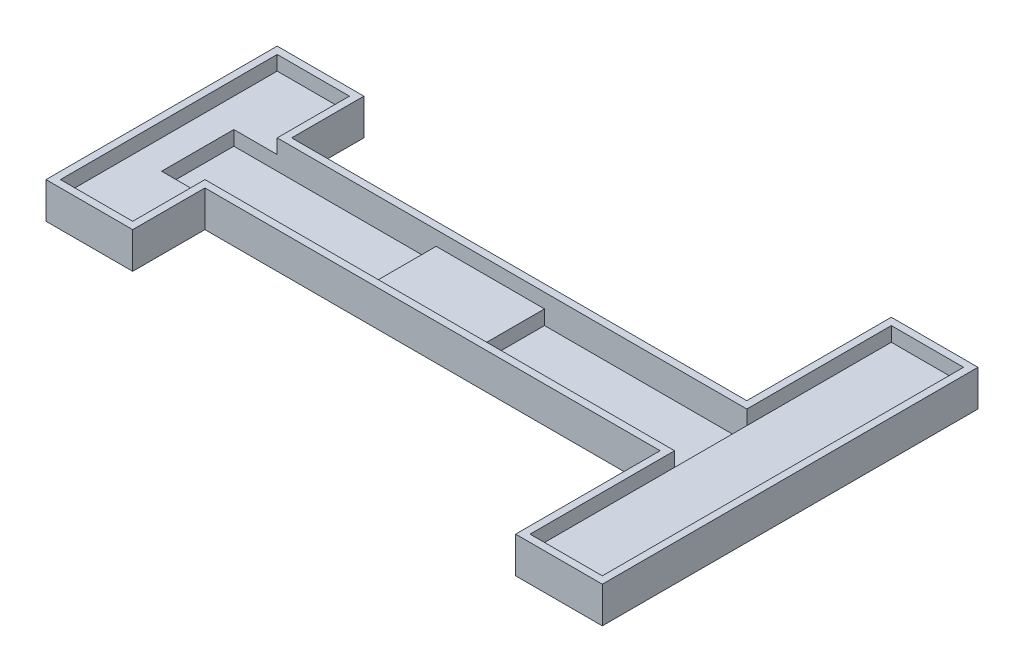
ISO-10303-21;
HEADER;
FILE_DESCRIPTION(('STEP AP214'),'2;1');
FILE_NAME('part.step','',(''),(''),'','','');
FILE_SCHEMA(('AUTOMOTIVE_DESIGN { 1 0 10303 214 1 1 1 1 }'));
ENDSEC;
DATA;
#1=APPLICATION_CONTEXT('core data for automotive mechanical design processes');
#2=APPLICATION_PROTOCOL_DEFINITION('international standard','automotive_design',2000,#1);
#3=PRODUCT_CONTEXT('',#1,'mechanical');
#4=PRODUCT('Part','Part','',(#3));
#5=PRODUCT_RELATED_PRODUCT_CATEGORY('part','',(#4));
#6=PRODUCT_DEFINITION_FORMATION('','',#4);
#7=PRODUCT_DEFINITION_CONTEXT('part definition',#1,'design');
#8=PRODUCT_DEFINITION('design','',#6,#7);
#9=PRODUCT_DEFINITION_SHAPE('','',#8);
#10=(LENGTH_UNIT() NAMED_UNIT(*) SI_UNIT(.MILLI.,.METRE.));
#11=(NAMED_UNIT(*) PLANE_ANGLE_UNIT() SI_UNIT($,.RADIAN.));
#12=(NAMED_UNIT(*) SI_UNIT($,.STERADIAN.) SOLID_ANGLE_UNIT());
#13=UNCERTAINTY_MEASURE_WITH_UNIT(LENGTH_MEASURE(1.E-05),#10,'distance_accuracy_value','');
#14=(GEOMETRIC_REPRESENTATION_CONTEXT(3) GLOBAL_UNCERTAINTY_ASSIGNED_CONTEXT((#13)) GLOBAL_UNIT_ASSIGNED_CONTEXT((#10,
#11,#12)) REPRESENTATION_CONTEXT('',''));
#15=CARTESIAN_POINT('',(0.,0.,0.));
#16=DIRECTION('',(0.,0.,1.));
#17=DIRECTION('',(1.,0.,0.));
#18=AXIS2_PLACEMENT_3D('',#15,#16,#17);
#19=CARTESIAN_POINT('',(0.,1.,0.));
#20=DIRECTION('',(0.,1.,0.));
#21=DIRECTION('',(0.,0.,1.));
#22=AXIS2_PLACEMENT_3D('',#19,#20,#21);
#23=PLANE('',#22);
#24=DIRECTION('',(1.,0.,0.));
#25=VECTOR('',#24,1.);
#26=CARTESIAN_POINT('',(0.,1.,-5.));
#27=LINE('',#26,#25);
#28=CARTESIAN_POINT('',(-57.,1.,-5.));
#29=VERTEX_POINT('',#28);
#30=CARTESIAN_POINT('',(-29.,1.,-5.));
#31=VERTEX_POINT('',#30);
#32=EDGE_CURVE('E45',#29,#31,#27,.T.);
#33=ORIENTED_EDGE('',*,*,#32,.F.);
#34=DIRECTION('',(0.,0.,-1.));
#35=VECTOR('',#34,1.);
#36=CARTESIAN_POINT('',(-57.,1.,-5.));
#37=LINE('',#36,#35);
#38=CARTESIAN_POINT('',(-57.,1.,5.));
#39=VERTEX_POINT('',#38);
#40=EDGE_CURVE('E249',#39,#29,#37,.T.);
#41=ORIENTED_EDGE('',*,*,#40,.F.);
#42=DIRECTION('',(1.,0.,0.));
#43=VECTOR('',#42,1.);
#44=CARTESIAN_POINT('',(0.,1.,5.));
#45=LINE('',#44,#43);
#46=CARTESIAN_POINT('',(-29.,1.,5.));
#47=VERTEX_POINT('',#46);
#48=EDGE_CURVE('E352',#39,#47,#45,.T.);
#49=ORIENTED_EDGE('',*,*,#48,.T.);
#50=DIRECTION('',(0.,0.,1.));
#51=VECTOR('',#50,1.);
#52=CARTESIAN_POINT('',(-29.,1.,-5.));
#53=LINE('',#52,#51);
#54=EDGE_CURVE('E393',#31,#47,#53,.T.);
#55=ORIENTED_EDGE('',*,*,#54,.F.);
#56=EDGE_LOOP('',(#33,#41,#49,#55));
#57=FACE_BOUND('',#56,.T.);
#58=ADVANCED_FACE('F37',(#57),#23,.T.);
#59=CARTESIAN_POINT('',(-14.,1.,5.));
#60=VERTEX_POINT('',#59);
#61=CARTESIAN_POINT('',(14.,1.,5.));
#62=VERTEX_POINT('',#61);
#63=EDGE_CURVE('E330',#60,#62,#45,.T.);
#64=ORIENTED_EDGE('',*,*,#63,.T.);
#65=DIRECTION('',(0.,0.,1.));
#66=VECTOR('',#65,1.);
#67=CARTESIAN_POINT('',(14.,1.,-25.));
#68=LINE('',#67,#66);
#69=CARTESIAN_POINT('',(14.,1.,-5.));
#70=VERTEX_POINT('',#69);
#71=EDGE_CURVE('E369',#70,#62,#68,.T.);
#72=ORIENTED_EDGE('',*,*,#71,.F.);
#73=CARTESIAN_POINT('',(-14.,1.,-5.));
#74=VERTEX_POINT('',#73);
#75=EDGE_CURVE('E354',#74,#70,#27,.T.);
#76=ORIENTED_EDGE('',*,*,#75,.F.);
#77=DIRECTION('',(0.,0.,-1.));
#78=VECTOR('',#77,1.);
#79=CARTESIAN_POINT('',(-14.,1.,-5.));
#80=LINE('',#79,#78);
#81=EDGE_CURVE('E367',#60,#74,#80,.T.);
#82=ORIENTED_EDGE('',*,*,#81,.F.);
#83=EDGE_LOOP('',(#64,#72,#76,#82));
#84=FACE_BOUND('',#83,.T.);
#85=ADVANCED_FACE('F366',(#84),#23,.T.);
#86=CARTESIAN_POINT('',(14.,0.,-5.));
#87=DIRECTION('',(0.,0.,-1.));
#88=DIRECTION('',(-1.,0.,0.));
#89=AXIS2_PLACEMENT_3D('',#86,#87,#88);
#90=PLANE('',#89);
#91=DIRECTION('',(0.,-1.,0.));
#92=VECTOR('',#91,1.);
#93=CARTESIAN_POINT('',(-29.,3.,-5.));
#94=LINE('',#93,#92);
#95=CARTESIAN_POINT('',(-29.,3.,-5.));
#96=VERTEX_POINT('',#95);
#97=EDGE_CURVE('E392',#96,#31,#94,.T.);
#98=ORIENTED_EDGE('',*,*,#97,.F.);
#99=DIRECTION('',(-1.,0.,0.));
#100=VECTOR('',#99,1.);
#101=CARTESIAN_POINT('',(-29.,3.,-5.));
#102=LINE('',#101,#100);
#103=CARTESIAN_POINT('',(-14.,3.,-5.));
#104=VERTEX_POINT('',#103);
#105=EDGE_CURVE('E390',#104,#96,#102,.T.);
#106=ORIENTED_EDGE('',*,*,#105,.F.);
#107=DIRECTION('',(0.,-1.,0.));
#108=VECTOR('',#107,1.);
#109=CARTESIAN_POINT('',(-14.,3.,-5.));
#110=LINE('',#109,#108);
#111=EDGE_CURVE('E361',#104,#74,#110,.T.);
#112=ORIENTED_EDGE('',*,*,#111,.T.);
#113=ORIENTED_EDGE('',*,*,#75,.T.);
#114=DIRECTION('',(0.,1.,0.));
#115=VECTOR('',#114,1.);
#116=CARTESIAN_POINT('',(14.,0.,-5.));
#117=LINE('',#116,#115);
#118=CARTESIAN_POINT('',(14.,3.,-5.));
#119=VERTEX_POINT('',#118);
#120=EDGE_CURVE('E265',#70,#119,#117,.T.);
#121=ORIENTED_EDGE('',*,*,#120,.T.);
#122=CARTESIAN_POINT('',(14.,5.,-5.));
#123=VERTEX_POINT('',#122);
#124=EDGE_CURVE('E270',#119,#123,#117,.T.);
#125=ORIENTED_EDGE('',*,*,#124,.T.);
#126=DIRECTION('',(-1.,0.,0.));
#127=VECTOR('',#126,1.);
#128=CARTESIAN_POINT('',(14.,5.,-5.));
#129=LINE('',#128,#127);
#130=CARTESIAN_POINT('',(-51.,5.,-5.));
#131=VERTEX_POINT('',#130);
#132=EDGE_CURVE('E263',#123,#131,#129,.T.);
#133=ORIENTED_EDGE('',*,*,#132,.T.);
#134=DIRECTION('',(0.,1.,0.));
#135=VECTOR('',#134,1.);
#136=CARTESIAN_POINT('',(-51.,0.,-5.));
#137=LINE('',#136,#135);
#138=CARTESIAN_POINT('',(-51.,3.,-5.));
#139=VERTEX_POINT('',#138);
#140=EDGE_CURVE('E255',#139,#131,#137,.T.);
#141=ORIENTED_EDGE('',*,*,#140,.F.);
#142=DIRECTION('',(1.,0.,0.));
#143=VECTOR('',#142,1.);
#144=CARTESIAN_POINT('',(-51.,3.,-5.));
#145=LINE('',#144,#143);
#146=CARTESIAN_POINT('',(-57.,3.,-5.));
#147=VERTEX_POINT('',#146);
#148=EDGE_CURVE('E238',#147,#139,#145,.T.);
#149=ORIENTED_EDGE('',*,*,#148,.F.);
#150=DIRECTION('',(0.,-1.,0.));
#151=VECTOR('',#150,1.);
#152=CARTESIAN_POINT('',(-57.,3.,-5.));
#153=LINE('',#152,#151);
#154=EDGE_CURVE('E377',#147,#29,#153,.T.);
#155=ORIENTED_EDGE('',*,*,#154,.T.);
#156=ORIENTED_EDGE('',*,*,#32,.T.);
#157=EDGE_LOOP('',(#98,#106,#112,#113,#121,#125,#133,#141,#149,#155,#156));
#158=FACE_BOUND('',#157,.T.);
#159=ADVANCED_FACE('F261',(#158),#90,.F.);
#160=CARTESIAN_POINT('',(-51.,0.,5.));
#161=DIRECTION('',(0.,0.,1.));
#162=DIRECTION('',(1.,0.,0.));
#163=AXIS2_PLACEMENT_3D('',#160,#161,#162);
#164=PLANE('',#163);
#165=DIRECTION('',(0.,-1.,0.));
#166=VECTOR('',#165,1.);
#167=CARTESIAN_POINT('',(-29.,3.,5.));
#168=LINE('',#167,#166);
#169=CARTESIAN_POINT('',(-29.,3.,5.));
#170=VERTEX_POINT('',#169);
#171=EDGE_CURVE('E400',#170,#47,#168,.T.);
#172=ORIENTED_EDGE('',*,*,#171,.T.);
#173=ORIENTED_EDGE('',*,*,#48,.F.);
#174=DIRECTION('',(0.,-1.,0.));
#175=VECTOR('',#174,1.);
#176=CARTESIAN_POINT('',(-57.,3.,5.));
#177=LINE('',#176,#175);
#178=CARTESIAN_POINT('',(-57.,3.,5.));
#179=VERTEX_POINT('',#178);
#180=EDGE_CURVE('E372',#179,#39,#177,.T.);
#181=ORIENTED_EDGE('',*,*,#180,.F.);
#182=DIRECTION('',(-1.,0.,0.));
#183=VECTOR('',#182,1.);
#184=CARTESIAN_POINT('',(-57.,3.,5.));
#185=LINE('',#184,#183);
#186=CARTESIAN_POINT('',(-51.,3.,5.));
#187=VERTEX_POINT('',#186);
#188=EDGE_CURVE('E491',#187,#179,#185,.T.);
#189=ORIENTED_EDGE('',*,*,#188,.F.);
#190=DIRECTION('',(0.,1.,0.));
#191=VECTOR('',#190,1.);
#192=CARTESIAN_POINT('',(-51.,0.,5.));
#193=LINE('',#192,#191);
#194=CARTESIAN_POINT('',(-51.,5.,5.));
#195=VERTEX_POINT('',#194);
#196=EDGE_CURVE('E285',#187,#195,#193,.T.);
#197=ORIENTED_EDGE('',*,*,#196,.T.);
#198=DIRECTION('',(1.,0.,0.));
#199=VECTOR('',#198,1.);
#200=CARTESIAN_POINT('',(-51.,5.,5.));
#201=LINE('',#200,#199);
#202=CARTESIAN_POINT('',(14.,5.,5.));
#203=VERTEX_POINT('',#202);
#204=EDGE_CURVE('E409',#195,#203,#201,.T.);
#205=ORIENTED_EDGE('',*,*,#204,.T.);
#206=DIRECTION('',(0.,1.,0.));
#207=VECTOR('',#206,1.);
#208=CARTESIAN_POINT('',(14.,0.,5.));
#209=LINE('',#208,#207);
#210=CARTESIAN_POINT('',(14.,3.,5.));
#211=VERTEX_POINT('',#210);
#212=EDGE_CURVE('E284',#211,#203,#209,.T.);
#213=ORIENTED_EDGE('',*,*,#212,.F.);
#214=EDGE_CURVE('E282',#62,#211,#209,.T.);
#215=ORIENTED_EDGE('',*,*,#214,.F.);
#216=ORIENTED_EDGE('',*,*,#63,.F.);
#217=DIRECTION('',(0.,-1.,0.));
#218=VECTOR('',#217,1.);
#219=CARTESIAN_POINT('',(-14.,3.,5.));
#220=LINE('',#219,#218);
#221=CARTESIAN_POINT('',(-14.,3.,5.));
#222=VERTEX_POINT('',#221);
#223=EDGE_CURVE('E398',#222,#60,#220,.T.);
#224=ORIENTED_EDGE('',*,*,#223,.F.);
#225=DIRECTION('',(1.,0.,0.));
#226=VECTOR('',#225,1.);
#227=CARTESIAN_POINT('',(-29.,3.,5.));
#228=LINE('',#227,#226);
#229=EDGE_CURVE('E386',#170,#222,#228,.T.);
#230=ORIENTED_EDGE('',*,*,#229,.F.);
#231=EDGE_LOOP('',(#172,#173,#181,#189,#197,#205,#213,#215,#216,#224,#230));
#232=FACE_BOUND('',#231,.T.);
#233=ADVANCED_FACE('F530',(#232),#164,.F.);
#234=CARTESIAN_POINT('',(-62.,0.,16.));
#235=DIRECTION('',(0.,0.,1.));
#236=DIRECTION('',(1.,0.,0.));
#237=AXIS2_PLACEMENT_3D('',#234,#235,#236);
#238=PLANE('',#237);
#239=DIRECTION('',(0.,1.,0.));
#240=VECTOR('',#239,1.);
#241=CARTESIAN_POINT('',(-50.,0.,16.));
#242=LINE('',#241,#240);
#243=CARTESIAN_POINT('',(-50.,0.,16.));
#244=VERTEX_POINT('',#243);
#245=CARTESIAN_POINT('',(-50.,5.,16.));
#246=VERTEX_POINT('',#245);
#247=EDGE_CURVE('E327',#244,#246,#242,.T.);
#248=ORIENTED_EDGE('',*,*,#247,.T.);
#249=DIRECTION('',(1.,0.,0.));
#250=VECTOR('',#249,1.);
#251=CARTESIAN_POINT('',(-62.,5.,16.));
#252=LINE('',#251,#250);
#253=CARTESIAN_POINT('',(-62.,5.,16.));
#254=VERTEX_POINT('',#253);
#255=EDGE_CURVE('E436',#254,#246,#252,.T.);
#256=ORIENTED_EDGE('',*,*,#255,.F.);
#257=DIRECTION('',(0.,1.,0.));
#258=VECTOR('',#257,1.);
#259=CARTESIAN_POINT('',(-62.,0.,16.));
#260=LINE('',#259,#258);
#261=CARTESIAN_POINT('',(-62.,0.,16.));
#262=VERTEX_POINT('',#261);
#263=EDGE_CURVE('E328',#262,#254,#260,.T.);
#264=ORIENTED_EDGE('',*,*,#263,.F.);
#265=DIRECTION('',(1.,0.,0.));
#266=VECTOR('',#265,1.);
#267=CARTESIAN_POINT('',(-62.,0.,16.));
#268=LINE('',#267,#266);
#269=EDGE_CURVE('E290',#262,#244,#268,.T.);
#270=ORIENTED_EDGE('',*,*,#269,.T.);
#271=EDGE_LOOP('',(#248,#256,#264,#270));
#272=FACE_BOUND('',#271,.T.);
#273=ADVANCED_FACE('F565',(#272),#238,.T.);
#274=CARTESIAN_POINT('',(-62.,0.,-16.));
#275=DIRECTION('',(-1.,0.,0.));
#276=DIRECTION('',(0.,0.,1.));
#277=AXIS2_PLACEMENT_3D('',#274,#275,#276);
#278=PLANE('',#277);
#279=ORIENTED_EDGE('',*,*,#263,.T.);
#280=DIRECTION('',(0.,0.,1.));
#281=VECTOR('',#280,1.);
#282=CARTESIAN_POINT('',(-62.,5.,-16.));
#283=LINE('',#282,#281);
#284=CARTESIAN_POINT('',(-62.,5.,-16.));
#285=VERTEX_POINT('',#284);
#286=EDGE_CURVE('E289',#285,#254,#283,.T.);
#287=ORIENTED_EDGE('',*,*,#286,.F.);
#288=DIRECTION('',(0.,1.,0.));
#289=VECTOR('',#288,1.);
#290=CARTESIAN_POINT('',(-62.,0.,-16.));
#291=LINE('',#290,#289);
#292=CARTESIAN_POINT('',(-62.,0.,-16.));
#293=VERTEX_POINT('',#292);
#294=EDGE_CURVE('E331',#293,#285,#291,.T.);
#295=ORIENTED_EDGE('',*,*,#294,.F.);
#296=DIRECTION('',(0.,0.,1.));
#297=VECTOR('',#296,1.);
#298=CARTESIAN_POINT('',(-62.,0.,-16.));
#299=LINE('',#298,#297);
#300=EDGE_CURVE('E324',#293,#262,#299,.T.);
#301=ORIENTED_EDGE('',*,*,#300,.T.);
#302=EDGE_LOOP('',(#279,#287,#295,#301));
#303=FACE_BOUND('',#302,.T.);
#304=ADVANCED_FACE('F568',(#303),#278,.T.);
#305=CARTESIAN_POINT('',(-50.,0.,-16.));
#306=DIRECTION('',(0.,0.,-1.));
#307=DIRECTION('',(-1.,0.,0.));
#308=AXIS2_PLACEMENT_3D('',#305,#306,#307);
#309=PLANE('',#308);
#310=ORIENTED_EDGE('',*,*,#294,.T.);
#311=DIRECTION('',(-1.,0.,0.));
#312=VECTOR('',#311,1.);
#313=CARTESIAN_POINT('',(-50.,5.,-16.));
#314=LINE('',#313,#312);
#315=CARTESIAN_POINT('',(-50.,5.,-16.));
#316=VERTEX_POINT('',#315);
#317=EDGE_CURVE('E466',#316,#285,#314,.T.);
#318=ORIENTED_EDGE('',*,*,#317,.F.);
#319=DIRECTION('',(0.,1.,0.));
#320=VECTOR('',#319,1.);
#321=CARTESIAN_POINT('',(-50.,0.,-16.));
#322=LINE('',#321,#320);
#323=CARTESIAN_POINT('',(-50.,0.,-16.));
#324=VERTEX_POINT('',#323);
#325=EDGE_CURVE('E333',#324,#316,#322,.T.);
#326=ORIENTED_EDGE('',*,*,#325,.F.);
#327=DIRECTION('',(-1.,0.,0.));
#328=VECTOR('',#327,1.);
#329=CARTESIAN_POINT('',(-50.,0.,-16.));
#330=LINE('',#329,#328);
#331=EDGE_CURVE('E321',#324,#293,#330,.T.);
#332=ORIENTED_EDGE('',*,*,#331,.T.);
#333=EDGE_LOOP('',(#310,#318,#326,#332));
#334=FACE_BOUND('',#333,.T.);
#335=ADVANCED_FACE('F605',(#334),#309,.T.);
#336=CARTESIAN_POINT('',(-50.,0.,-6.));
#337=DIRECTION('',(1.,0.,0.));
#338=DIRECTION('',(0.,0.,-1.));
#339=AXIS2_PLACEMENT_3D('',#336,#337,#338);
#340=PLANE('',#339);
#341=ORIENTED_EDGE('',*,*,#325,.T.);
#342=DIRECTION('',(0.,0.,-1.));
#343=VECTOR('',#342,1.);
#344=CARTESIAN_POINT('',(-50.,5.,-6.));
#345=LINE('',#344,#343);
#346=CARTESIAN_POINT('',(-50.,5.,-6.));
#347=VERTEX_POINT('',#346);
#348=EDGE_CURVE('E463',#347,#316,#345,.T.);
#349=ORIENTED_EDGE('',*,*,#348,.F.);
#350=DIRECTION('',(0.,1.,0.));
#351=VECTOR('',#350,1.);
#352=CARTESIAN_POINT('',(-50.,0.,-6.));
#353=LINE('',#352,#351);
#354=CARTESIAN_POINT('',(-50.,0.,-6.));
#355=VERTEX_POINT('',#354);
#356=EDGE_CURVE('E335',#355,#347,#353,.T.);
#357=ORIENTED_EDGE('',*,*,#356,.F.);
#358=DIRECTION('',(0.,0.,-1.));
#359=VECTOR('',#358,1.);
#360=CARTESIAN_POINT('',(-50.,0.,-6.));
#361=LINE('',#360,#359);
#362=EDGE_CURVE('E318',#355,#324,#361,.T.);
#363=ORIENTED_EDGE('',*,*,#362,.T.);
#364=EDGE_LOOP('',(#341,#349,#357,#363));
#365=FACE_BOUND('',#364,.T.);
#366=ADVANCED_FACE('F601',(#365),#340,.T.);
#367=CARTESIAN_POINT('',(13.,0.,-6.));
#368=DIRECTION('',(0.,0.,-1.));
#369=DIRECTION('',(-1.,0.,0.));
#370=AXIS2_PLACEMENT_3D('',#367,#368,#369);
#371=PLANE('',#370);
#372=ORIENTED_EDGE('',*,*,#356,.T.);
#373=DIRECTION('',(-1.,0.,0.));
#374=VECTOR('',#373,1.);
#375=CARTESIAN_POINT('',(13.,5.,-6.));
#376=LINE('',#375,#374);
#377=CARTESIAN_POINT('',(13.,5.,-6.));
#378=VERTEX_POINT('',#377);
#379=EDGE_CURVE('E460',#378,#347,#376,.T.);
#380=ORIENTED_EDGE('',*,*,#379,.F.);
#381=DIRECTION('',(0.,1.,0.));
#382=VECTOR('',#381,1.);
#383=CARTESIAN_POINT('',(13.,0.,-6.));
#384=LINE('',#383,#382);
#385=CARTESIAN_POINT('',(13.,0.,-6.));
#386=VERTEX_POINT('',#385);
#387=EDGE_CURVE('E337',#386,#378,#384,.T.);
#388=ORIENTED_EDGE('',*,*,#387,.F.);
#389=DIRECTION('',(-1.,0.,0.));
#390=VECTOR('',#389,1.);
#391=CARTESIAN_POINT('',(13.,0.,-6.));
#392=LINE('',#391,#390);
#393=EDGE_CURVE('E315',#386,#355,#392,.T.);
#394=ORIENTED_EDGE('',*,*,#393,.T.);
#395=EDGE_LOOP('',(#372,#380,#388,#394));
#396=FACE_BOUND('',#395,.T.);
#397=ADVANCED_FACE('F597',(#396),#371,.T.);
#398=CARTESIAN_POINT('',(13.,0.,-26.));
#399=DIRECTION('',(-1.,0.,0.));
#400=DIRECTION('',(0.,0.,1.));
#401=AXIS2_PLACEMENT_3D('',#398,#399,#400);
#402=PLANE('',#401);
#403=ORIENTED_EDGE('',*,*,#387,.T.);
#404=DIRECTION('',(0.,0.,1.));
#405=VECTOR('',#404,1.);
#406=CARTESIAN_POINT('',(13.,5.,-26.));
#407=LINE('',#406,#405);
#408=CARTESIAN_POINT('',(13.,5.,-26.));
#409=VERTEX_POINT('',#408);
#410=EDGE_CURVE('E457',#409,#378,#407,.T.);
#411=ORIENTED_EDGE('',*,*,#410,.F.);
#412=DIRECTION('',(0.,1.,0.));
#413=VECTOR('',#412,1.);
#414=CARTESIAN_POINT('',(13.,0.,-26.));
#415=LINE('',#414,#413);
#416=CARTESIAN_POINT('',(13.,0.,-26.));
#417=VERTEX_POINT('',#416);
#418=EDGE_CURVE('E339',#417,#409,#415,.T.);
#419=ORIENTED_EDGE('',*,*,#418,.F.);
#420=DIRECTION('',(0.,0.,1.));
#421=VECTOR('',#420,1.);
#422=CARTESIAN_POINT('',(13.,0.,-26.));
#423=LINE('',#422,#421);
#424=EDGE_CURVE('E312',#417,#386,#423,.T.);
#425=ORIENTED_EDGE('',*,*,#424,.T.);
#426=EDGE_LOOP('',(#403,#411,#419,#425));
#427=FACE_BOUND('',#426,.T.);
#428=ADVANCED_FACE('F593',(#427),#402,.T.);
#429=CARTESIAN_POINT('',(25.,0.,-26.));
#430=DIRECTION('',(0.,0.,-1.));
#431=DIRECTION('',(-1.,0.,0.));
#432=AXIS2_PLACEMENT_3D('',#429,#430,#431);
#433=PLANE('',#432);
#434=ORIENTED_EDGE('',*,*,#418,.T.);
#435=DIRECTION('',(-1.,0.,0.));
#436=VECTOR('',#435,1.);
#437=CARTESIAN_POINT('',(25.,5.,-26.));
#438=LINE('',#437,#436);
#439=CARTESIAN_POINT('',(25.,5.,-26.));
#440=VERTEX_POINT('',#439);
#441=EDGE_CURVE('E454',#440,#409,#438,.T.);
#442=ORIENTED_EDGE('',*,*,#441,.F.);
#443=DIRECTION('',(0.,1.,0.));
#444=VECTOR('',#443,1.);
#445=CARTESIAN_POINT('',(25.,0.,-26.));
#446=LINE('',#445,#444);
#447=CARTESIAN_POINT('',(25.,0.,-26.));
#448=VERTEX_POINT('',#447);
#449=EDGE_CURVE('E341',#448,#440,#446,.T.);
#450=ORIENTED_EDGE('',*,*,#449,.F.);
#451=DIRECTION('',(-1.,0.,0.));
#452=VECTOR('',#451,1.);
#453=CARTESIAN_POINT('',(25.,0.,-26.));
#454=LINE('',#453,#452);
#455=EDGE_CURVE('E309',#448,#417,#454,.T.);
#456=ORIENTED_EDGE('',*,*,#455,.T.);
#457=EDGE_LOOP('',(#434,#442,#450,#456));
#458=FACE_BOUND('',#457,.T.);
#459=ADVANCED_FACE('F589',(#458),#433,.T.);
#460=CARTESIAN_POINT('',(25.,0.,26.));
#461=DIRECTION('',(1.,0.,0.));
#462=DIRECTION('',(0.,0.,-1.));
#463=AXIS2_PLACEMENT_3D('',#460,#461,#462);
#464=PLANE('',#463);
#465=ORIENTED_EDGE('',*,*,#449,.T.);
#466=DIRECTION('',(0.,0.,-1.));
#467=VECTOR('',#466,1.);
#468=CARTESIAN_POINT('',(25.,5.,26.));
#469=LINE('',#468,#467);
#470=CARTESIAN_POINT('',(25.,5.,26.));
#471=VERTEX_POINT('',#470);
#472=EDGE_CURVE('E451',#471,#440,#469,.T.);
#473=ORIENTED_EDGE('',*,*,#472,.F.);
#474=DIRECTION('',(0.,1.,0.));
#475=VECTOR('',#474,1.);
#476=CARTESIAN_POINT('',(25.,0.,26.));
#477=LINE('',#476,#475);
#478=CARTESIAN_POINT('',(25.,0.,26.));
#479=VERTEX_POINT('',#478);
#480=EDGE_CURVE('E343',#479,#471,#477,.T.);
#481=ORIENTED_EDGE('',*,*,#480,.F.);
#482=DIRECTION('',(0.,0.,-1.));
#483=VECTOR('',#482,1.);
#484=CARTESIAN_POINT('',(25.,0.,26.));
#485=LINE('',#484,#483);
#486=EDGE_CURVE('E306',#479,#448,#485,.T.);
#487=ORIENTED_EDGE('',*,*,#486,.T.);
#488=EDGE_LOOP('',(#465,#473,#481,#487));
#489=FACE_BOUND('',#488,.T.);
#490=ADVANCED_FACE('F585',(#489),#464,.T.);
#491=CARTESIAN_POINT('',(13.,0.,26.));
#492=DIRECTION('',(0.,0.,1.));
#493=DIRECTION('',(1.,0.,0.));
#494=AXIS2_PLACEMENT_3D('',#491,#492,#493);
#495=PLANE('',#494);
#496=ORIENTED_EDGE('',*,*,#480,.T.);
#497=DIRECTION('',(1.,0.,0.));
#498=VECTOR('',#497,1.);
#499=CARTESIAN_POINT('',(13.,5.,26.));
#500=LINE('',#499,#498);
#501=CARTESIAN_POINT('',(13.,5.,26.));
#502=VERTEX_POINT('',#501);
#503=EDGE_CURVE('E448',#502,#471,#500,.T.);
#504=ORIENTED_EDGE('',*,*,#503,.F.);
#505=DIRECTION('',(0.,1.,0.));
#506=VECTOR('',#505,1.);
#507=CARTESIAN_POINT('',(13.,0.,26.));
#508=LINE('',#507,#506);
#509=CARTESIAN_POINT('',(13.,0.,26.));
#510=VERTEX_POINT('',#509);
#511=EDGE_CURVE('E345',#510,#502,#508,.T.);
#512=ORIENTED_EDGE('',*,*,#511,.F.);
#513=DIRECTION('',(1.,0.,0.));
#514=VECTOR('',#513,1.);
#515=CARTESIAN_POINT('',(13.,0.,26.));
#516=LINE('',#515,#514);
#517=EDGE_CURVE('E303',#510,#479,#516,.T.);
#518=ORIENTED_EDGE('',*,*,#517,.T.);
#519=EDGE_LOOP('',(#496,#504,#512,#518));
#520=FACE_BOUND('',#519,.T.);
#521=ADVANCED_FACE('F581',(#520),#495,.T.);
#522=CARTESIAN_POINT('',(13.,0.,6.));
#523=DIRECTION('',(-1.,0.,0.));
#524=DIRECTION('',(0.,0.,1.));
#525=AXIS2_PLACEMENT_3D('',#522,#523,#524);
#526=PLANE('',#525);
#527=ORIENTED_EDGE('',*,*,#511,.T.);
#528=DIRECTION('',(0.,0.,1.));
#529=VECTOR('',#528,1.);
#530=CARTESIAN_POINT('',(13.,5.,6.));
#531=LINE('',#530,#529);
#532=CARTESIAN_POINT('',(13.,5.,6.));
#533=VERTEX_POINT('',#532);
#534=EDGE_CURVE('E445',#533,#502,#531,.T.);
#535=ORIENTED_EDGE('',*,*,#534,.F.);
#536=DIRECTION('',(0.,1.,0.));
#537=VECTOR('',#536,1.);
#538=CARTESIAN_POINT('',(13.,0.,6.));
#539=LINE('',#538,#537);
#540=CARTESIAN_POINT('',(13.,0.,6.));
#541=VERTEX_POINT('',#540);
#542=EDGE_CURVE('E347',#541,#533,#539,.T.);
#543=ORIENTED_EDGE('',*,*,#542,.F.);
#544=DIRECTION('',(0.,0.,1.));
#545=VECTOR('',#544,1.);
#546=CARTESIAN_POINT('',(13.,0.,6.));
#547=LINE('',#546,#545);
#548=EDGE_CURVE('E300',#541,#510,#547,.T.);
#549=ORIENTED_EDGE('',*,*,#548,.T.);
#550=EDGE_LOOP('',(#527,#535,#543,#549));
#551=FACE_BOUND('',#550,.T.);
#552=ADVANCED_FACE('F577',(#551),#526,.T.);
#553=CARTESIAN_POINT('',(-50.,0.,6.));
#554=DIRECTION('',(0.,0.,1.));
#555=DIRECTION('',(1.,0.,0.));
#556=AXIS2_PLACEMENT_3D('',#553,#554,#555);
#557=PLANE('',#556);
#558=ORIENTED_EDGE('',*,*,#542,.T.);
#559=DIRECTION('',(1.,0.,0.));
#560=VECTOR('',#559,1.);
#561=CARTESIAN_POINT('',(-50.,5.,6.));
#562=LINE('',#561,#560);
#563=CARTESIAN_POINT('',(-50.,5.,6.));
#564=VERTEX_POINT('',#563);
#565=EDGE_CURVE('E442',#564,#533,#562,.T.);
#566=ORIENTED_EDGE('',*,*,#565,.F.);
#567=DIRECTION('',(0.,1.,0.));
#568=VECTOR('',#567,1.);
#569=CARTESIAN_POINT('',(-50.,0.,6.));
#570=LINE('',#569,#568);
#571=CARTESIAN_POINT('',(-50.,0.,6.));
#572=VERTEX_POINT('',#571);
#573=EDGE_CURVE('E349',#572,#564,#570,.T.);
#574=ORIENTED_EDGE('',*,*,#573,.F.);
#575=DIRECTION('',(1.,0.,0.));
#576=VECTOR('',#575,1.);
#577=CARTESIAN_POINT('',(-50.,0.,6.));
#578=LINE('',#577,#576);
#579=EDGE_CURVE('E297',#572,#541,#578,.T.);
#580=ORIENTED_EDGE('',*,*,#579,.T.);
#581=EDGE_LOOP('',(#558,#566,#574,#580));
#582=FACE_BOUND('',#581,.T.);
#583=ADVANCED_FACE('F573',(#582),#557,.T.);
#584=CARTESIAN_POINT('',(-50.,0.,16.));
#585=DIRECTION('',(1.,0.,0.));
#586=DIRECTION('',(0.,0.,-1.));
#587=AXIS2_PLACEMENT_3D('',#584,#585,#586);
#588=PLANE('',#587);
#589=ORIENTED_EDGE('',*,*,#573,.T.);
#590=DIRECTION('',(0.,0.,-1.));
#591=VECTOR('',#590,1.);
#592=CARTESIAN_POINT('',(-50.,5.,16.));
#593=LINE('',#592,#591);
#594=EDGE_CURVE('E439',#246,#564,#593,.T.);
#595=ORIENTED_EDGE('',*,*,#594,.F.);
#596=ORIENTED_EDGE('',*,*,#247,.F.);
#597=DIRECTION('',(0.,0.,-1.));
#598=VECTOR('',#597,1.);
#599=CARTESIAN_POINT('',(-50.,0.,16.));
#600=LINE('',#599,#598);
#601=EDGE_CURVE('E293',#244,#572,#600,.T.);
#602=ORIENTED_EDGE('',*,*,#601,.T.);
#603=EDGE_LOOP('',(#589,#595,#596,#602));
#604=FACE_BOUND('',#603,.T.);
#605=ADVANCED_FACE('F570',(#604),#588,.T.);
#606=CARTESIAN_POINT('',(-61.,0.,15.));
#607=DIRECTION('',(0.,0.,1.));
#608=DIRECTION('',(1.,0.,0.));
#609=AXIS2_PLACEMENT_3D('',#606,#607,#608);
#610=PLANE('',#609);
#611=DIRECTION('',(0.,1.,0.));
#612=VECTOR('',#611,1.);
#613=CARTESIAN_POINT('',(-51.,0.,15.));
#614=LINE('',#613,#612);
#615=CARTESIAN_POINT('',(-51.,3.,15.));
#616=VERTEX_POINT('',#615);
#617=CARTESIAN_POINT('',(-51.,5.,15.));
#618=VERTEX_POINT('',#617);
#619=EDGE_CURVE('E287',#616,#618,#614,.T.);
#620=ORIENTED_EDGE('',*,*,#619,.F.);
#621=DIRECTION('',(1.,0.,0.));
#622=VECTOR('',#621,1.);
#623=CARTESIAN_POINT('',(-51.,3.,15.));
#624=LINE('',#623,#622);
#625=CARTESIAN_POINT('',(-61.,3.,15.));
#626=VERTEX_POINT('',#625);
#627=EDGE_CURVE('E52',#626,#616,#624,.T.);
#628=ORIENTED_EDGE('',*,*,#627,.F.);
#629=DIRECTION('',(0.,1.,0.));
#630=VECTOR('',#629,1.);
#631=CARTESIAN_POINT('',(-61.,0.,15.));
#632=LINE('',#631,#630);
#633=CARTESIAN_POINT('',(-61.,5.,15.));
#634=VERTEX_POINT('',#633);
#635=EDGE_CURVE('E294',#626,#634,#632,.T.);
#636=ORIENTED_EDGE('',*,*,#635,.T.);
#637=DIRECTION('',(1.,0.,0.));
#638=VECTOR('',#637,1.);
#639=CARTESIAN_POINT('',(-61.,5.,15.));
#640=LINE('',#639,#638);
#641=EDGE_CURVE('E403',#634,#618,#640,.T.);
#642=ORIENTED_EDGE('',*,*,#641,.T.);
#643=EDGE_LOOP('',(#620,#628,#636,#642));
#644=FACE_BOUND('',#643,.T.);
#645=ADVANCED_FACE('F488',(#644),#610,.F.);
#646=CARTESIAN_POINT('',(-61.,0.,-15.));
#647=DIRECTION('',(-1.,0.,0.));
#648=DIRECTION('',(0.,0.,1.));
#649=AXIS2_PLACEMENT_3D('',#646,#647,#648);
#650=PLANE('',#649);
#651=ORIENTED_EDGE('',*,*,#635,.F.);
#652=DIRECTION('',(0.,0.,1.));
#653=VECTOR('',#652,1.);
#654=CARTESIAN_POINT('',(-61.,3.,15.));
#655=LINE('',#654,#653);
#656=CARTESIAN_POINT('',(-61.,3.,-15.));
#657=VERTEX_POINT('',#656);
#658=EDGE_CURVE('E478',#657,#626,#655,.T.);
#659=ORIENTED_EDGE('',*,*,#658,.F.);
#660=DIRECTION('',(0.,1.,0.));
#661=VECTOR('',#660,1.);
#662=CARTESIAN_POINT('',(-61.,0.,-15.));
#663=LINE('',#662,#661);
#664=CARTESIAN_POINT('',(-61.,5.,-15.));
#665=VERTEX_POINT('',#664);
#666=EDGE_CURVE('E267',#657,#665,#663,.T.);
#667=ORIENTED_EDGE('',*,*,#666,.T.);
#668=DIRECTION('',(0.,0.,1.));
#669=VECTOR('',#668,1.);
#670=CARTESIAN_POINT('',(-61.,5.,-15.));
#671=LINE('',#670,#669);
#672=EDGE_CURVE('E433',#665,#634,#671,.T.);
#673=ORIENTED_EDGE('',*,*,#672,.T.);
#674=EDGE_LOOP('',(#651,#659,#667,#673));
#675=FACE_BOUND('',#674,.T.);
#676=ADVANCED_FACE('F475',(#675),#650,.F.);
#677=CARTESIAN_POINT('',(-51.,0.,-15.));
#678=DIRECTION('',(0.,0.,-1.));
#679=DIRECTION('',(-1.,0.,0.));
#680=AXIS2_PLACEMENT_3D('',#677,#678,#679);
#681=PLANE('',#680);
#682=ORIENTED_EDGE('',*,*,#666,.F.);
#683=DIRECTION('',(-1.,0.,0.));
#684=VECTOR('',#683,1.);
#685=CARTESIAN_POINT('',(-61.,3.,-15.));
#686=LINE('',#685,#684);
#687=CARTESIAN_POINT('',(-51.,3.,-15.));
#688=VERTEX_POINT('',#687);
#689=EDGE_CURVE('E258',#688,#657,#686,.T.);
#690=ORIENTED_EDGE('',*,*,#689,.F.);
#691=DIRECTION('',(0.,1.,0.));
#692=VECTOR('',#691,1.);
#693=CARTESIAN_POINT('',(-51.,0.,-15.));
#694=LINE('',#693,#692);
#695=CARTESIAN_POINT('',(-51.,5.,-15.));
#696=VERTEX_POINT('',#695);
#697=EDGE_CURVE('E257',#688,#696,#694,.T.);
#698=ORIENTED_EDGE('',*,*,#697,.T.);
#699=DIRECTION('',(-1.,0.,0.));
#700=VECTOR('',#699,1.);
#701=CARTESIAN_POINT('',(-51.,5.,-15.));
#702=LINE('',#701,#700);
#703=EDGE_CURVE('E430',#696,#665,#702,.T.);
#704=ORIENTED_EDGE('',*,*,#703,.T.);
#705=EDGE_LOOP('',(#682,#690,#698,#704));
#706=FACE_BOUND('',#705,.T.);
#707=ADVANCED_FACE('F481',(#706),#681,.F.);
#708=CARTESIAN_POINT('',(-51.,0.,-5.));
#709=DIRECTION('',(1.,0.,0.));
#710=DIRECTION('',(0.,0.,-1.));
#711=AXIS2_PLACEMENT_3D('',#708,#709,#710);
#712=PLANE('',#711);
#713=ORIENTED_EDGE('',*,*,#697,.F.);
#714=DIRECTION('',(0.,0.,-1.));
#715=VECTOR('',#714,1.);
#716=CARTESIAN_POINT('',(-51.,3.,-15.));
#717=LINE('',#716,#715);
#718=EDGE_CURVE('E241',#139,#688,#717,.T.);
#719=ORIENTED_EDGE('',*,*,#718,.F.);
#720=ORIENTED_EDGE('',*,*,#140,.T.);
#721=DIRECTION('',(0.,0.,-1.));
#722=VECTOR('',#721,1.);
#723=CARTESIAN_POINT('',(-51.,5.,-5.));
#724=LINE('',#723,#722);
#725=EDGE_CURVE('E428',#131,#696,#724,.T.);
#726=ORIENTED_EDGE('',*,*,#725,.T.);
#727=EDGE_LOOP('',(#713,#719,#720,#726));
#728=FACE_BOUND('',#727,.T.);
#729=ADVANCED_FACE('F253',(#728),#712,.F.);
#730=CARTESIAN_POINT('',(14.,0.,-25.));
#731=DIRECTION('',(-1.,0.,0.));
#732=DIRECTION('',(0.,0.,1.));
#733=AXIS2_PLACEMENT_3D('',#730,#731,#732);
#734=PLANE('',#733);
#735=ORIENTED_EDGE('',*,*,#124,.F.);
#736=DIRECTION('',(0.,0.,1.));
#737=VECTOR('',#736,1.);
#738=CARTESIAN_POINT('',(14.,3.,-25.));
#739=LINE('',#738,#737);
#740=CARTESIAN_POINT('',(14.,3.,-25.));
#741=VERTEX_POINT('',#740);
#742=EDGE_CURVE('E374',#741,#119,#739,.T.);
#743=ORIENTED_EDGE('',*,*,#742,.F.);
#744=DIRECTION('',(0.,1.,0.));
#745=VECTOR('',#744,1.);
#746=CARTESIAN_POINT('',(14.,0.,-25.));
#747=LINE('',#746,#745);
#748=CARTESIAN_POINT('',(14.,5.,-25.));
#749=VERTEX_POINT('',#748);
#750=EDGE_CURVE('E274',#741,#749,#747,.T.);
#751=ORIENTED_EDGE('',*,*,#750,.T.);
#752=DIRECTION('',(0.,0.,1.));
#753=VECTOR('',#752,1.);
#754=CARTESIAN_POINT('',(14.,5.,-25.));
#755=LINE('',#754,#753);
#756=EDGE_CURVE('E424',#749,#123,#755,.T.);
#757=ORIENTED_EDGE('',*,*,#756,.T.);
#758=EDGE_LOOP('',(#735,#743,#751,#757));
#759=FACE_BOUND('',#758,.T.);
#760=ADVANCED_FACE('F512',(#759),#734,.F.);
#761=CARTESIAN_POINT('',(24.,0.,-25.));
#762=DIRECTION('',(0.,0.,-1.));
#763=DIRECTION('',(-1.,0.,0.));
#764=AXIS2_PLACEMENT_3D('',#761,#762,#763);
#765=PLANE('',#764);
#766=ORIENTED_EDGE('',*,*,#750,.F.);
#767=DIRECTION('',(-1.,0.,0.));
#768=VECTOR('',#767,1.);
#769=CARTESIAN_POINT('',(14.,3.,-25.));
#770=LINE('',#769,#768);
#771=CARTESIAN_POINT('',(24.,3.,-25.));
#772=VERTEX_POINT('',#771);
#773=EDGE_CURVE('E381',#772,#741,#770,.T.);
#774=ORIENTED_EDGE('',*,*,#773,.F.);
#775=DIRECTION('',(0.,1.,0.));
#776=VECTOR('',#775,1.);
#777=CARTESIAN_POINT('',(24.,0.,-25.));
#778=LINE('',#777,#776);
#779=CARTESIAN_POINT('',(24.,5.,-25.));
#780=VERTEX_POINT('',#779);
#781=EDGE_CURVE('E276',#772,#780,#778,.T.);
#782=ORIENTED_EDGE('',*,*,#781,.T.);
#783=DIRECTION('',(-1.,0.,0.));
#784=VECTOR('',#783,1.);
#785=CARTESIAN_POINT('',(24.,5.,-25.));
#786=LINE('',#785,#784);
#787=EDGE_CURVE('E421',#780,#749,#786,.T.);
#788=ORIENTED_EDGE('',*,*,#787,.T.);
#789=EDGE_LOOP('',(#766,#774,#782,#788));
#790=FACE_BOUND('',#789,.T.);
#791=ADVANCED_FACE('F513',(#790),#765,.F.);
#792=CARTESIAN_POINT('',(24.,0.,25.));
#793=DIRECTION('',(1.,0.,0.));
#794=DIRECTION('',(0.,0.,-1.));
#795=AXIS2_PLACEMENT_3D('',#792,#793,#794);
#796=PLANE('',#795);
#797=ORIENTED_EDGE('',*,*,#781,.F.);
#798=DIRECTION('',(0.,0.,-1.));
#799=VECTOR('',#798,1.);
#800=CARTESIAN_POINT('',(24.,3.,-25.));
#801=LINE('',#800,#799);
#802=CARTESIAN_POINT('',(24.,3.,25.));
#803=VERTEX_POINT('',#802);
#804=EDGE_CURVE('E502',#803,#772,#801,.T.);
#805=ORIENTED_EDGE('',*,*,#804,.F.);
#806=DIRECTION('',(0.,1.,0.));
#807=VECTOR('',#806,1.);
#808=CARTESIAN_POINT('',(24.,0.,25.));
#809=LINE('',#808,#807);
#810=CARTESIAN_POINT('',(24.,5.,25.));
#811=VERTEX_POINT('',#810);
#812=EDGE_CURVE('E278',#803,#811,#809,.T.);
#813=ORIENTED_EDGE('',*,*,#812,.T.);
#814=DIRECTION('',(0.,0.,-1.));
#815=VECTOR('',#814,1.);
#816=CARTESIAN_POINT('',(24.,5.,25.));
#817=LINE('',#816,#815);
#818=EDGE_CURVE('E418',#811,#780,#817,.T.);
#819=ORIENTED_EDGE('',*,*,#818,.T.);
#820=EDGE_LOOP('',(#797,#805,#813,#819));
#821=FACE_BOUND('',#820,.T.);
#822=ADVANCED_FACE('F520',(#821),#796,.F.);
#823=CARTESIAN_POINT('',(14.,0.,25.));
#824=DIRECTION('',(0.,0.,1.));
#825=DIRECTION('',(1.,0.,0.));
#826=AXIS2_PLACEMENT_3D('',#823,#824,#825);
#827=PLANE('',#826);
#828=ORIENTED_EDGE('',*,*,#812,.F.);
#829=DIRECTION('',(1.,0.,0.));
#830=VECTOR('',#829,1.);
#831=CARTESIAN_POINT('',(14.,3.,25.));
#832=LINE('',#831,#830);
#833=CARTESIAN_POINT('',(14.,3.,25.));
#834=VERTEX_POINT('',#833);
#835=EDGE_CURVE('E501',#834,#803,#832,.T.);
#836=ORIENTED_EDGE('',*,*,#835,.F.);
#837=DIRECTION('',(0.,1.,0.));
#838=VECTOR('',#837,1.);
#839=CARTESIAN_POINT('',(14.,0.,25.));
#840=LINE('',#839,#838);
#841=CARTESIAN_POINT('',(14.,5.,25.));
#842=VERTEX_POINT('',#841);
#843=EDGE_CURVE('E280',#834,#842,#840,.T.);
#844=ORIENTED_EDGE('',*,*,#843,.T.);
#845=DIRECTION('',(1.,0.,0.));
#846=VECTOR('',#845,1.);
#847=CARTESIAN_POINT('',(14.,5.,25.));
#848=LINE('',#847,#846);
#849=EDGE_CURVE('E415',#842,#811,#848,.T.);
#850=ORIENTED_EDGE('',*,*,#849,.T.);
#851=EDGE_LOOP('',(#828,#836,#844,#850));
#852=FACE_BOUND('',#851,.T.);
#853=ADVANCED_FACE('F524',(#852),#827,.F.);
#854=CARTESIAN_POINT('',(14.,0.,5.));
#855=DIRECTION('',(-1.,0.,0.));
#856=DIRECTION('',(0.,0.,1.));
#857=AXIS2_PLACEMENT_3D('',#854,#855,#856);
#858=PLANE('',#857);
#859=ORIENTED_EDGE('',*,*,#843,.F.);
#860=DIRECTION('',(0.,0.,-1.));
#861=VECTOR('',#860,1.);
#862=CARTESIAN_POINT('',(14.,3.,5.));
#863=LINE('',#862,#861);
#864=EDGE_CURVE('E11',#834,#211,#863,.T.);
#865=ORIENTED_EDGE('',*,*,#864,.T.);
#866=ORIENTED_EDGE('',*,*,#212,.T.);
#867=DIRECTION('',(0.,0.,1.));
#868=VECTOR('',#867,1.);
#869=CARTESIAN_POINT('',(14.,5.,5.));
#870=LINE('',#869,#868);
#871=EDGE_CURVE('E412',#203,#842,#870,.T.);
#872=ORIENTED_EDGE('',*,*,#871,.T.);
#873=EDGE_LOOP('',(#859,#865,#866,#872));
#874=FACE_BOUND('',#873,.T.);
#875=ADVANCED_FACE('F527',(#874),#858,.F.);
#876=CARTESIAN_POINT('',(-51.,0.,15.));
#877=DIRECTION('',(1.,0.,0.));
#878=DIRECTION('',(0.,0.,-1.));
#879=AXIS2_PLACEMENT_3D('',#876,#877,#878);
#880=PLANE('',#879);
#881=ORIENTED_EDGE('',*,*,#196,.F.);
#882=DIRECTION('',(0.,0.,-1.));
#883=VECTOR('',#882,1.);
#884=CARTESIAN_POINT('',(-51.,3.,5.));
#885=LINE('',#884,#883);
#886=EDGE_CURVE('E489',#616,#187,#885,.T.);
#887=ORIENTED_EDGE('',*,*,#886,.F.);
#888=ORIENTED_EDGE('',*,*,#619,.T.);
#889=DIRECTION('',(0.,0.,-1.));
#890=VECTOR('',#889,1.);
#891=CARTESIAN_POINT('',(-51.,5.,15.));
#892=LINE('',#891,#890);
#893=EDGE_CURVE('E406',#618,#195,#892,.T.);
#894=ORIENTED_EDGE('',*,*,#893,.T.);
#895=EDGE_LOOP('',(#881,#887,#888,#894));
#896=FACE_BOUND('',#895,.T.);
#897=ADVANCED_FACE('F535',(#896),#880,.F.);
#898=CARTESIAN_POINT('',(0.,5.,0.));
#899=DIRECTION('',(0.,1.,0.));
#900=DIRECTION('',(0.,0.,1.));
#901=AXIS2_PLACEMENT_3D('',#898,#899,#900);
#902=PLANE('',#901);
#903=ORIENTED_EDGE('',*,*,#255,.T.);
#904=ORIENTED_EDGE('',*,*,#594,.T.);
#905=ORIENTED_EDGE('',*,*,#565,.T.);
#906=ORIENTED_EDGE('',*,*,#534,.T.);
#907=ORIENTED_EDGE('',*,*,#503,.T.);
#908=ORIENTED_EDGE('',*,*,#472,.T.);
#909=ORIENTED_EDGE('',*,*,#441,.T.);
#910=ORIENTED_EDGE('',*,*,#410,.T.);
#911=ORIENTED_EDGE('',*,*,#379,.T.);
#912=ORIENTED_EDGE('',*,*,#348,.T.);
#913=ORIENTED_EDGE('',*,*,#317,.T.);
#914=ORIENTED_EDGE('',*,*,#286,.T.);
#915=EDGE_LOOP('',(#903,#904,#905,#906,#907,#908,#909,#910,#911,#912,#913,#914));
#916=FACE_BOUND('',#915,.T.);
#917=ORIENTED_EDGE('',*,*,#893,.F.);
#918=ORIENTED_EDGE('',*,*,#641,.F.);
#919=ORIENTED_EDGE('',*,*,#672,.F.);
#920=ORIENTED_EDGE('',*,*,#703,.F.);
#921=ORIENTED_EDGE('',*,*,#725,.F.);
#922=ORIENTED_EDGE('',*,*,#132,.F.);
#923=ORIENTED_EDGE('',*,*,#756,.F.);
#924=ORIENTED_EDGE('',*,*,#787,.F.);
#925=ORIENTED_EDGE('',*,*,#818,.F.);
#926=ORIENTED_EDGE('',*,*,#849,.F.);
#927=ORIENTED_EDGE('',*,*,#871,.F.);
#928=ORIENTED_EDGE('',*,*,#204,.F.);
#929=EDGE_LOOP('',(#917,#918,#919,#920,#921,#922,#923,#924,#925,#926,#927,#928));
#930=FACE_BOUND('',#929,.T.);
#931=ADVANCED_FACE('F484',(#916,#930),#902,.T.);
#932=CARTESIAN_POINT('',(0.,0.,0.));
#933=DIRECTION('',(0.,1.,0.));
#934=DIRECTION('',(0.,0.,1.));
#935=AXIS2_PLACEMENT_3D('',#932,#933,#934);
#936=PLANE('',#935);
#937=ORIENTED_EDGE('',*,*,#269,.F.);
#938=ORIENTED_EDGE('',*,*,#300,.F.);
#939=ORIENTED_EDGE('',*,*,#331,.F.);
#940=ORIENTED_EDGE('',*,*,#362,.F.);
#941=ORIENTED_EDGE('',*,*,#393,.F.);
#942=ORIENTED_EDGE('',*,*,#424,.F.);
#943=ORIENTED_EDGE('',*,*,#455,.F.);
#944=ORIENTED_EDGE('',*,*,#486,.F.);
#945=ORIENTED_EDGE('',*,*,#517,.F.);
#946=ORIENTED_EDGE('',*,*,#548,.F.);
#947=ORIENTED_EDGE('',*,*,#579,.F.);
#948=ORIENTED_EDGE('',*,*,#601,.F.);
#949=EDGE_LOOP('',(#937,#938,#939,#940,#941,#942,#943,#944,#945,#946,#947,#948));
#950=FACE_BOUND('',#949,.T.);
#951=ADVANCED_FACE('F39',(#950),#936,.F.);
#952=CARTESIAN_POINT('',(-29.,3.,-5.));
#953=DIRECTION('',(1.,0.,0.));
#954=DIRECTION('',(0.,0.,-1.));
#955=AXIS2_PLACEMENT_3D('',#952,#953,#954);
#956=PLANE('',#955);
#957=ORIENTED_EDGE('',*,*,#54,.T.);
#958=ORIENTED_EDGE('',*,*,#171,.F.);
#959=DIRECTION('',(0.,0.,1.));
#960=VECTOR('',#959,1.);
#961=CARTESIAN_POINT('',(-29.,3.,-5.));
#962=LINE('',#961,#960);
#963=EDGE_CURVE('E383',#96,#170,#962,.T.);
#964=ORIENTED_EDGE('',*,*,#963,.F.);
#965=ORIENTED_EDGE('',*,*,#97,.T.);
#966=EDGE_LOOP('',(#957,#958,#964,#965));
#967=FACE_BOUND('',#966,.T.);
#968=ADVANCED_FACE('F542',(#967),#956,.F.);
#969=CARTESIAN_POINT('',(-14.,3.,-5.));
#970=DIRECTION('',(-1.,0.,0.));
#971=DIRECTION('',(0.,0.,1.));
#972=AXIS2_PLACEMENT_3D('',#969,#970,#971);
#973=PLANE('',#972);
#974=ORIENTED_EDGE('',*,*,#81,.T.);
#975=ORIENTED_EDGE('',*,*,#111,.F.);
#976=DIRECTION('',(0.,0.,-1.));
#977=VECTOR('',#976,1.);
#978=CARTESIAN_POINT('',(-14.,3.,-5.));
#979=LINE('',#978,#977);
#980=EDGE_CURVE('E388',#222,#104,#979,.T.);
#981=ORIENTED_EDGE('',*,*,#980,.F.);
#982=ORIENTED_EDGE('',*,*,#223,.T.);
#983=EDGE_LOOP('',(#974,#975,#981,#982));
#984=FACE_BOUND('',#983,.T.);
#985=ADVANCED_FACE('F550',(#984),#973,.F.);
#986=CARTESIAN_POINT('',(0.,3.,0.));
#987=DIRECTION('',(0.,1.,0.));
#988=DIRECTION('',(0.,0.,1.));
#989=AXIS2_PLACEMENT_3D('',#986,#987,#988);
#990=PLANE('',#989);
#991=ORIENTED_EDGE('',*,*,#963,.T.);
#992=ORIENTED_EDGE('',*,*,#229,.T.);
#993=ORIENTED_EDGE('',*,*,#980,.T.);
#994=ORIENTED_EDGE('',*,*,#105,.T.);
#995=EDGE_LOOP('',(#991,#992,#993,#994));
#996=FACE_BOUND('',#995,.T.);
#997=ADVANCED_FACE('F548',(#996),#990,.T.);
#998=CARTESIAN_POINT('',(14.,3.,-25.));
#999=DIRECTION('',(1.,0.,0.));
#1000=DIRECTION('',(0.,0.,-1.));
#1001=AXIS2_PLACEMENT_3D('',#998,#999,#1000);
#1002=PLANE('',#1001);
#1003=EDGE_CURVE('E60',#119,#211,#739,.T.);
#1004=ORIENTED_EDGE('',*,*,#1003,.F.);
#1005=ORIENTED_EDGE('',*,*,#120,.F.);
#1006=ORIENTED_EDGE('',*,*,#71,.T.);
#1007=ORIENTED_EDGE('',*,*,#214,.T.);
#1008=EDGE_LOOP('',(#1004,#1005,#1006,#1007));
#1009=FACE_BOUND('',#1008,.T.);
#1010=ADVANCED_FACE('F557',(#1009),#1002,.F.);
#1011=CARTESIAN_POINT('',(0.,3.,0.));
#1012=DIRECTION('',(0.,1.,0.));
#1013=DIRECTION('',(0.,0.,1.));
#1014=AXIS2_PLACEMENT_3D('',#1011,#1012,#1013);
#1015=PLANE('',#1014);
#1016=ORIENTED_EDGE('',*,*,#742,.T.);
#1017=ORIENTED_EDGE('',*,*,#1003,.T.);
#1018=ORIENTED_EDGE('',*,*,#864,.F.);
#1019=ORIENTED_EDGE('',*,*,#835,.T.);
#1020=ORIENTED_EDGE('',*,*,#804,.T.);
#1021=ORIENTED_EDGE('',*,*,#773,.T.);
#1022=EDGE_LOOP('',(#1016,#1017,#1018,#1019,#1020,#1021));
#1023=FACE_BOUND('',#1022,.T.);
#1024=ADVANCED_FACE('F506',(#1023),#1015,.T.);
#1025=CARTESIAN_POINT('',(-57.,3.,-5.));
#1026=DIRECTION('',(-1.,0.,0.));
#1027=DIRECTION('',(0.,0.,1.));
#1028=AXIS2_PLACEMENT_3D('',#1025,#1026,#1027);
#1029=PLANE('',#1028);
#1030=ORIENTED_EDGE('',*,*,#40,.T.);
#1031=ORIENTED_EDGE('',*,*,#154,.F.);
#1032=DIRECTION('',(0.,0.,-1.));
#1033=VECTOR('',#1032,1.);
#1034=CARTESIAN_POINT('',(-57.,3.,-5.));
#1035=LINE('',#1034,#1033);
#1036=EDGE_CURVE('E244',#179,#147,#1035,.T.);
#1037=ORIENTED_EDGE('',*,*,#1036,.F.);
#1038=ORIENTED_EDGE('',*,*,#180,.T.);
#1039=EDGE_LOOP('',(#1030,#1031,#1037,#1038));
#1040=FACE_BOUND('',#1039,.T.);
#1041=ADVANCED_FACE('F538',(#1040),#1029,.F.);
#1042=CARTESIAN_POINT('',(0.,3.,0.));
#1043=DIRECTION('',(0.,1.,0.));
#1044=DIRECTION('',(0.,0.,1.));
#1045=AXIS2_PLACEMENT_3D('',#1042,#1043,#1044);
#1046=PLANE('',#1045);
#1047=ORIENTED_EDGE('',*,*,#148,.T.);
#1048=ORIENTED_EDGE('',*,*,#718,.T.);
#1049=ORIENTED_EDGE('',*,*,#689,.T.);
#1050=ORIENTED_EDGE('',*,*,#658,.T.);
#1051=ORIENTED_EDGE('',*,*,#627,.T.);
#1052=ORIENTED_EDGE('',*,*,#886,.T.);
#1053=ORIENTED_EDGE('',*,*,#188,.T.);
#1054=ORIENTED_EDGE('',*,*,#1036,.T.);
#1055=EDGE_LOOP('',(#1047,#1048,#1049,#1050,#1051,#1052,#1053,#1054));
#1056=FACE_BOUND('',#1055,.T.);
#1057=ADVANCED_FACE('F240',(#1056),#1046,.T.);
#1058=CLOSED_SHELL('',(#58,#85,#159,#233,#273,#304,#335,#366,#397,#428,#459,#490,#521,#552,#583,
#605,#645,#676,#707,#729,#760,#791,#822,#853,#875,#897,#931,#951,#968,#985,#997,#1010,#1024,
#1041,#1057));
#1059=MANIFOLD_SOLID_BREP('B2',#1058);
#1060=ADVANCED_BREP_SHAPE_REPRESENTATION('',(#18,#1059),#14);
#1061=SHAPE_DEFINITION_REPRESENTATION(#9,#1060);
ENDSEC;
END-ISO-10303-21;
